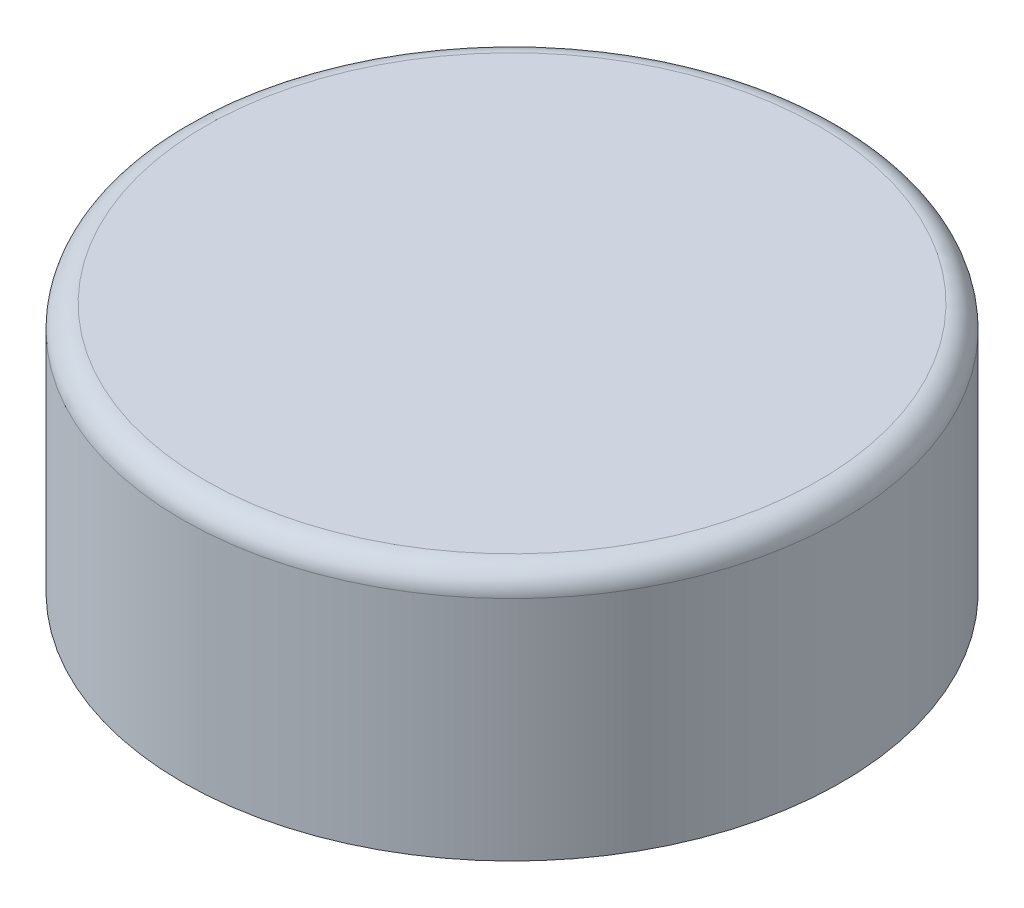
ISO-10303-21;
HEADER;
FILE_DESCRIPTION(('STEP AP214'),'2;1');
FILE_NAME('part.step','',(''),(''),'','','');
FILE_SCHEMA(('AUTOMOTIVE_DESIGN { 1 0 10303 214 1 1 1 1 }'));
ENDSEC;
DATA;
#1=APPLICATION_CONTEXT('core data for automotive mechanical design processes');
#2=APPLICATION_PROTOCOL_DEFINITION('international standard','automotive_design',2000,#1);
#3=PRODUCT_CONTEXT('',#1,'mechanical');
#4=PRODUCT('Part','Part','',(#3));
#5=PRODUCT_RELATED_PRODUCT_CATEGORY('part','',(#4));
#6=PRODUCT_DEFINITION_FORMATION('','',#4);
#7=PRODUCT_DEFINITION_CONTEXT('part definition',#1,'design');
#8=PRODUCT_DEFINITION('design','',#6,#7);
#9=PRODUCT_DEFINITION_SHAPE('','',#8);
#10=(LENGTH_UNIT() NAMED_UNIT(*) SI_UNIT(.MILLI.,.METRE.));
#11=(NAMED_UNIT(*) PLANE_ANGLE_UNIT() SI_UNIT($,.RADIAN.));
#12=(NAMED_UNIT(*) SI_UNIT($,.STERADIAN.) SOLID_ANGLE_UNIT());
#13=UNCERTAINTY_MEASURE_WITH_UNIT(LENGTH_MEASURE(1.E-05),#10,'distance_accuracy_value','');
#14=(GEOMETRIC_REPRESENTATION_CONTEXT(3) GLOBAL_UNCERTAINTY_ASSIGNED_CONTEXT((#13)) GLOBAL_UNIT_ASSIGNED_CONTEXT((#10,
#11,#12)) REPRESENTATION_CONTEXT('',''));
#15=CARTESIAN_POINT('',(0.,0.,0.));
#16=DIRECTION('',(0.,0.,1.));
#17=DIRECTION('',(1.,0.,0.));
#18=AXIS2_PLACEMENT_3D('',#15,#16,#17);
#19=CARTESIAN_POINT('',(0.,1.1,0.));
#20=DIRECTION('',(0.,-1.,0.));
#21=DIRECTION('',(0.,0.,-1.));
#22=AXIS2_PLACEMENT_3D('',#19,#20,#21);
#23=CYLINDRICAL_SURFACE('',#22,1.45);
#24=CARTESIAN_POINT('',(0.,1.,0.));
#25=DIRECTION('',(0.,1.,0.));
#26=DIRECTION('',(0.,0.,1.));
#27=AXIS2_PLACEMENT_3D('',#24,#25,#26);
#28=CIRCLE('',#27,1.45);
#29=CARTESIAN_POINT('',(0.,1.,1.45));
#30=VERTEX_POINT('',#29);
#31=EDGE_CURVE('E10',#30,#30,#28,.F.);
#32=ORIENTED_EDGE('',*,*,#31,.T.);
#33=EDGE_LOOP('',(#32));
#34=FACE_BOUND('',#33,.T.);
#35=CARTESIAN_POINT('',(0.,0.,0.));
#36=DIRECTION('',(0.,1.,0.));
#37=DIRECTION('',(0.,0.,1.));
#38=AXIS2_PLACEMENT_3D('',#35,#36,#37);
#39=CIRCLE('',#38,1.45);
#40=CARTESIAN_POINT('',(0.,0.,1.45));
#41=VERTEX_POINT('',#40);
#42=EDGE_CURVE('E41',#41,#41,#39,.T.);
#43=ORIENTED_EDGE('',*,*,#42,.T.);
#44=EDGE_LOOP('',(#43));
#45=FACE_BOUND('',#44,.T.);
#46=ADVANCED_FACE('F30',(#34,#45),#23,.T.);
#47=CARTESIAN_POINT('',(0.,1.1,0.));
#48=DIRECTION('',(0.,1.,0.));
#49=DIRECTION('',(0.,0.,1.));
#50=AXIS2_PLACEMENT_3D('',#47,#48,#49);
#51=PLANE('',#50);
#52=CARTESIAN_POINT('',(0.,1.1,0.));
#53=DIRECTION('',(0.,1.,0.));
#54=DIRECTION('',(0.,0.,1.));
#55=AXIS2_PLACEMENT_3D('',#52,#53,#54);
#56=CIRCLE('',#55,1.35);
#57=CARTESIAN_POINT('',(0.,1.1,1.35));
#58=VERTEX_POINT('',#57);
#59=EDGE_CURVE('E37',#58,#58,#56,.T.);
#60=ORIENTED_EDGE('',*,*,#59,.T.);
#61=EDGE_LOOP('',(#60));
#62=FACE_BOUND('',#61,.T.);
#63=ADVANCED_FACE('F51',(#62),#51,.T.);
#64=CARTESIAN_POINT('',(0.,0.,0.));
#65=DIRECTION('',(0.,1.,0.));
#66=DIRECTION('',(0.,0.,1.));
#67=AXIS2_PLACEMENT_3D('',#64,#65,#66);
#68=PLANE('',#67);
#69=ORIENTED_EDGE('',*,*,#42,.F.);
#70=EDGE_LOOP('',(#69));
#71=FACE_BOUND('',#70,.T.);
#72=ADVANCED_FACE('F49',(#71),#68,.F.);
#73=CARTESIAN_POINT('',(0.,1.,0.));
#74=DIRECTION('',(0.,1.,0.));
#75=DIRECTION('',(0.,0.,1.));
#76=AXIS2_PLACEMENT_3D('',#73,#74,#75);
#77=TOROIDAL_SURFACE('',#76,1.35,0.1);
#78=ORIENTED_EDGE('',*,*,#31,.F.);
#79=EDGE_LOOP('',(#78));
#80=FACE_BOUND('',#79,.T.);
#81=ORIENTED_EDGE('',*,*,#59,.F.);
#82=EDGE_LOOP('',(#81));
#83=FACE_BOUND('',#82,.T.);
#84=ADVANCED_FACE('F32',(#80,#83),#77,.T.);
#85=CLOSED_SHELL('',(#46,#63,#72,#84));
#86=MANIFOLD_SOLID_BREP('B2',#85);
#87=ADVANCED_BREP_SHAPE_REPRESENTATION('',(#18,#86),#14);
#88=SHAPE_DEFINITION_REPRESENTATION(#9,#87);
ENDSEC;
END-ISO-10303-21;
